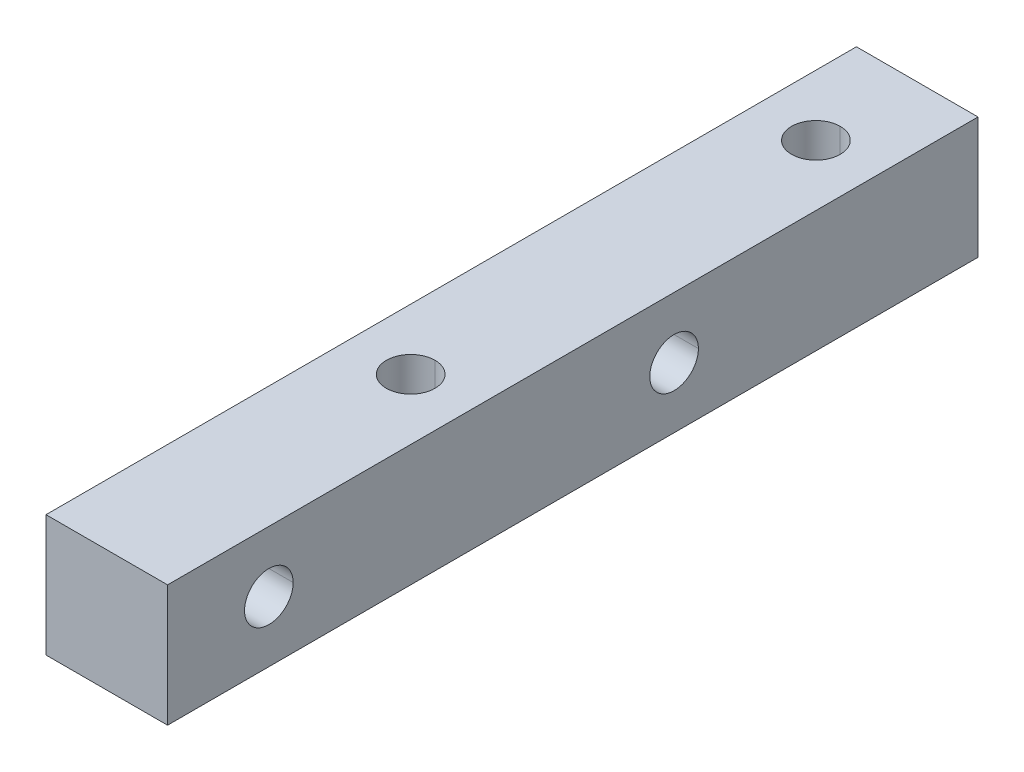
ISO-10303-21;
HEADER;
FILE_DESCRIPTION(('STEP AP214'),'2;1');
FILE_NAME('part.step','',(''),(''),'','','');
FILE_SCHEMA(('AUTOMOTIVE_DESIGN { 1 0 10303 214 1 1 1 1 }'));
ENDSEC;
DATA;
#1=APPLICATION_CONTEXT('core data for automotive mechanical design processes');
#2=APPLICATION_PROTOCOL_DEFINITION('international standard','automotive_design',2000,#1);
#3=PRODUCT_CONTEXT('',#1,'mechanical');
#4=PRODUCT('Part','Part','',(#3));
#5=PRODUCT_RELATED_PRODUCT_CATEGORY('part','',(#4));
#6=PRODUCT_DEFINITION_FORMATION('','',#4);
#7=PRODUCT_DEFINITION_CONTEXT('part definition',#1,'design');
#8=PRODUCT_DEFINITION('design','',#6,#7);
#9=PRODUCT_DEFINITION_SHAPE('','',#8);
#10=(LENGTH_UNIT() NAMED_UNIT(*) SI_UNIT(.MILLI.,.METRE.));
#11=(NAMED_UNIT(*) PLANE_ANGLE_UNIT() SI_UNIT($,.RADIAN.));
#12=(NAMED_UNIT(*) SI_UNIT($,.STERADIAN.) SOLID_ANGLE_UNIT());
#13=UNCERTAINTY_MEASURE_WITH_UNIT(LENGTH_MEASURE(1.E-05),#10,'distance_accuracy_value','');
#14=(GEOMETRIC_REPRESENTATION_CONTEXT(3) GLOBAL_UNCERTAINTY_ASSIGNED_CONTEXT((#13)) GLOBAL_UNIT_ASSIGNED_CONTEXT((#10,
#11,#12)) REPRESENTATION_CONTEXT('',''));
#15=CARTESIAN_POINT('',(0.,0.,0.));
#16=DIRECTION('',(0.,0.,1.));
#17=DIRECTION('',(1.,0.,0.));
#18=AXIS2_PLACEMENT_3D('',#15,#16,#17);
#19=CARTESIAN_POINT('',(50.,3.,35.));
#20=DIRECTION('',(-1.,0.,0.));
#21=DIRECTION('',(0.,0.,1.));
#22=AXIS2_PLACEMENT_3D('',#19,#20,#21);
#23=CYLINDRICAL_SURFACE('',#22,1.2);
#24=DIRECTION('',(-1.,0.,0.));
#25=VECTOR('',#24,1.);
#26=CARTESIAN_POINT('',(50.,3.,33.8));
#27=LINE('',#26,#25);
#28=CARTESIAN_POINT('',(6.,3.,33.8));
#29=VERTEX_POINT('',#28);
#30=CARTESIAN_POINT('',(0.,3.,33.8));
#31=VERTEX_POINT('',#30);
#32=EDGE_CURVE('E148',#29,#31,#27,.T.);
#33=ORIENTED_EDGE('',*,*,#32,.F.);
#34=CARTESIAN_POINT('',(6.,3.,35.));
#35=DIRECTION('',(-1.,0.,0.));
#36=DIRECTION('',(0.,0.,1.));
#37=AXIS2_PLACEMENT_3D('',#34,#35,#36);
#38=CIRCLE('',#37,1.2);
#39=CARTESIAN_POINT('',(6.,3.,36.2));
#40=VERTEX_POINT('',#39);
#41=EDGE_CURVE('E126',#40,#29,#38,.T.);
#42=ORIENTED_EDGE('',*,*,#41,.F.);
#43=DIRECTION('',(-1.,0.,0.));
#44=VECTOR('',#43,1.);
#45=CARTESIAN_POINT('',(50.,3.,36.2));
#46=LINE('',#45,#44);
#47=CARTESIAN_POINT('',(0.,3.,36.2));
#48=VERTEX_POINT('',#47);
#49=EDGE_CURVE('E159',#40,#48,#46,.T.);
#50=ORIENTED_EDGE('',*,*,#49,.T.);
#51=CARTESIAN_POINT('',(0.,3.,35.));
#52=DIRECTION('',(-1.,0.,0.));
#53=DIRECTION('',(0.,0.,1.));
#54=AXIS2_PLACEMENT_3D('',#51,#52,#53);
#55=CIRCLE('',#54,1.2);
#56=EDGE_CURVE('E109',#48,#31,#55,.T.);
#57=ORIENTED_EDGE('',*,*,#56,.T.);
#58=EDGE_LOOP('',(#33,#42,#50,#57));
#59=FACE_BOUND('',#58,.T.);
#60=ADVANCED_FACE('F16',(#59),#23,.F.);
#61=CARTESIAN_POINT('',(50.,3.,15.));
#62=DIRECTION('',(-1.,0.,0.));
#63=DIRECTION('',(0.,0.,1.));
#64=AXIS2_PLACEMENT_3D('',#61,#62,#63);
#65=CYLINDRICAL_SURFACE('',#64,1.2);
#66=DIRECTION('',(-1.,0.,0.));
#67=VECTOR('',#66,1.);
#68=CARTESIAN_POINT('',(50.,3.,13.8));
#69=LINE('',#68,#67);
#70=CARTESIAN_POINT('',(6.,3.,13.8));
#71=VERTEX_POINT('',#70);
#72=CARTESIAN_POINT('',(0.,3.,13.8));
#73=VERTEX_POINT('',#72);
#74=EDGE_CURVE('E168',#71,#73,#69,.T.);
#75=ORIENTED_EDGE('',*,*,#74,.F.);
#76=CARTESIAN_POINT('',(6.,3.,15.));
#77=DIRECTION('',(-1.,0.,0.));
#78=DIRECTION('',(0.,0.,1.));
#79=AXIS2_PLACEMENT_3D('',#76,#77,#78);
#80=CIRCLE('',#79,1.2);
#81=CARTESIAN_POINT('',(6.,3.,16.2));
#82=VERTEX_POINT('',#81);
#83=EDGE_CURVE('E132',#82,#71,#80,.T.);
#84=ORIENTED_EDGE('',*,*,#83,.F.);
#85=DIRECTION('',(-1.,0.,0.));
#86=VECTOR('',#85,1.);
#87=CARTESIAN_POINT('',(50.,3.,16.2));
#88=LINE('',#87,#86);
#89=CARTESIAN_POINT('',(0.,3.,16.2));
#90=VERTEX_POINT('',#89);
#91=EDGE_CURVE('E176',#82,#90,#88,.T.);
#92=ORIENTED_EDGE('',*,*,#91,.T.);
#93=CARTESIAN_POINT('',(0.,3.,15.));
#94=DIRECTION('',(-1.,0.,0.));
#95=DIRECTION('',(0.,0.,1.));
#96=AXIS2_PLACEMENT_3D('',#93,#94,#95);
#97=CIRCLE('',#96,1.2);
#98=EDGE_CURVE('E102',#90,#73,#97,.T.);
#99=ORIENTED_EDGE('',*,*,#98,.T.);
#100=EDGE_LOOP('',(#75,#84,#92,#99));
#101=FACE_BOUND('',#100,.T.);
#102=ADVANCED_FACE('F313',(#101),#65,.F.);
#103=CARTESIAN_POINT('',(3.,-44.,5.));
#104=DIRECTION('',(0.,1.,0.));
#105=DIRECTION('',(0.,0.,1.));
#106=AXIS2_PLACEMENT_3D('',#103,#104,#105);
#107=CYLINDRICAL_SURFACE('',#106,1.2);
#108=DIRECTION('',(0.,1.,0.));
#109=VECTOR('',#108,1.);
#110=CARTESIAN_POINT('',(3.,-44.,3.8));
#111=LINE('',#110,#109);
#112=CARTESIAN_POINT('',(3.,0.,3.8));
#113=VERTEX_POINT('',#112);
#114=CARTESIAN_POINT('',(3.,6.,3.8));
#115=VERTEX_POINT('',#114);
#116=EDGE_CURVE('E163',#113,#115,#111,.T.);
#117=ORIENTED_EDGE('',*,*,#116,.F.);
#118=CARTESIAN_POINT('',(3.,0.,5.));
#119=DIRECTION('',(0.,1.,0.));
#120=DIRECTION('',(0.,0.,1.));
#121=AXIS2_PLACEMENT_3D('',#118,#119,#120);
#122=CIRCLE('',#121,1.2);
#123=CARTESIAN_POINT('',(3.,0.,6.2));
#124=VERTEX_POINT('',#123);
#125=EDGE_CURVE('E114',#124,#113,#122,.T.);
#126=ORIENTED_EDGE('',*,*,#125,.F.);
#127=DIRECTION('',(0.,1.,0.));
#128=VECTOR('',#127,1.);
#129=CARTESIAN_POINT('',(3.,-44.,6.2));
#130=LINE('',#129,#128);
#131=CARTESIAN_POINT('',(3.,6.,6.2));
#132=VERTEX_POINT('',#131);
#133=EDGE_CURVE('E150',#124,#132,#130,.T.);
#134=ORIENTED_EDGE('',*,*,#133,.T.);
#135=CARTESIAN_POINT('',(3.,6.,5.));
#136=DIRECTION('',(0.,1.,0.));
#137=DIRECTION('',(0.,0.,1.));
#138=AXIS2_PLACEMENT_3D('',#135,#136,#137);
#139=CIRCLE('',#138,1.2);
#140=EDGE_CURVE('E24',#132,#115,#139,.T.);
#141=ORIENTED_EDGE('',*,*,#140,.T.);
#142=EDGE_LOOP('',(#117,#126,#134,#141));
#143=FACE_BOUND('',#142,.T.);
#144=ADVANCED_FACE('F261',(#143),#107,.F.);
#145=CARTESIAN_POINT('',(3.,-44.,25.));
#146=DIRECTION('',(0.,1.,0.));
#147=DIRECTION('',(0.,0.,1.));
#148=AXIS2_PLACEMENT_3D('',#145,#146,#147);
#149=CYLINDRICAL_SURFACE('',#148,1.2);
#150=DIRECTION('',(0.,1.,0.));
#151=VECTOR('',#150,1.);
#152=CARTESIAN_POINT('',(3.,-44.,23.8));
#153=LINE('',#152,#151);
#154=CARTESIAN_POINT('',(3.,0.,23.8));
#155=VERTEX_POINT('',#154);
#156=CARTESIAN_POINT('',(3.,6.,23.8));
#157=VERTEX_POINT('',#156);
#158=EDGE_CURVE('E187',#155,#157,#153,.T.);
#159=ORIENTED_EDGE('',*,*,#158,.F.);
#160=CARTESIAN_POINT('',(3.,0.,25.));
#161=DIRECTION('',(0.,1.,0.));
#162=DIRECTION('',(0.,0.,1.));
#163=AXIS2_PLACEMENT_3D('',#160,#161,#162);
#164=CIRCLE('',#163,1.2);
#165=CARTESIAN_POINT('',(3.,0.,26.2));
#166=VERTEX_POINT('',#165);
#167=EDGE_CURVE('E86',#166,#155,#164,.T.);
#168=ORIENTED_EDGE('',*,*,#167,.F.);
#169=DIRECTION('',(0.,1.,0.));
#170=VECTOR('',#169,1.);
#171=CARTESIAN_POINT('',(3.,-44.,26.2));
#172=LINE('',#171,#170);
#173=CARTESIAN_POINT('',(3.,6.,26.2));
#174=VERTEX_POINT('',#173);
#175=EDGE_CURVE('E192',#166,#174,#172,.T.);
#176=ORIENTED_EDGE('',*,*,#175,.T.);
#177=CARTESIAN_POINT('',(3.,6.,25.));
#178=DIRECTION('',(0.,1.,0.));
#179=DIRECTION('',(0.,0.,1.));
#180=AXIS2_PLACEMENT_3D('',#177,#178,#179);
#181=CIRCLE('',#180,1.2);
#182=EDGE_CURVE('E10',#174,#157,#181,.T.);
#183=ORIENTED_EDGE('',*,*,#182,.T.);
#184=EDGE_LOOP('',(#159,#168,#176,#183));
#185=FACE_BOUND('',#184,.T.);
#186=ADVANCED_FACE('F342',(#185),#149,.F.);
#187=CARTESIAN_POINT('',(0.,0.,0.));
#188=DIRECTION('',(0.,0.,-1.));
#189=DIRECTION('',(0.,-1.,0.));
#190=AXIS2_PLACEMENT_3D('',#187,#188,#189);
#191=PLANE('',#190);
#192=DIRECTION('',(0.,-1.,0.));
#193=VECTOR('',#192,1.);
#194=CARTESIAN_POINT('',(0.,0.,0.));
#195=LINE('',#194,#193);
#196=CARTESIAN_POINT('',(0.,6.,0.));
#197=VERTEX_POINT('',#196);
#198=CARTESIAN_POINT('',(0.,0.,0.));
#199=VERTEX_POINT('',#198);
#200=EDGE_CURVE('E196',#197,#199,#195,.T.);
#201=ORIENTED_EDGE('',*,*,#200,.F.);
#202=DIRECTION('',(-1.,0.,0.));
#203=VECTOR('',#202,1.);
#204=CARTESIAN_POINT('',(0.,6.,0.));
#205=LINE('',#204,#203);
#206=CARTESIAN_POINT('',(6.,6.,0.));
#207=VERTEX_POINT('',#206);
#208=EDGE_CURVE('E51',#207,#197,#205,.T.);
#209=ORIENTED_EDGE('',*,*,#208,.F.);
#210=DIRECTION('',(0.,1.,0.));
#211=VECTOR('',#210,1.);
#212=CARTESIAN_POINT('',(6.,0.,0.));
#213=LINE('',#212,#211);
#214=CARTESIAN_POINT('',(6.,0.,0.));
#215=VERTEX_POINT('',#214);
#216=EDGE_CURVE('E76',#215,#207,#213,.T.);
#217=ORIENTED_EDGE('',*,*,#216,.F.);
#218=DIRECTION('',(1.,0.,0.));
#219=VECTOR('',#218,1.);
#220=CARTESIAN_POINT('',(0.,0.,0.));
#221=LINE('',#220,#219);
#222=EDGE_CURVE('E80',#199,#215,#221,.T.);
#223=ORIENTED_EDGE('',*,*,#222,.F.);
#224=EDGE_LOOP('',(#201,#209,#217,#223));
#225=FACE_BOUND('',#224,.T.);
#226=ADVANCED_FACE('F78',(#225),#191,.T.);
#227=CARTESIAN_POINT('',(0.,0.,40.));
#228=DIRECTION('',(0.,0.,-1.));
#229=DIRECTION('',(0.,-1.,0.));
#230=AXIS2_PLACEMENT_3D('',#227,#228,#229);
#231=PLANE('',#230);
#232=DIRECTION('',(0.,-1.,0.));
#233=VECTOR('',#232,1.);
#234=CARTESIAN_POINT('',(0.,0.,40.));
#235=LINE('',#234,#233);
#236=CARTESIAN_POINT('',(0.,6.,40.));
#237=VERTEX_POINT('',#236);
#238=CARTESIAN_POINT('',(0.,0.,40.));
#239=VERTEX_POINT('',#238);
#240=EDGE_CURVE('E201',#237,#239,#235,.T.);
#241=ORIENTED_EDGE('',*,*,#240,.T.);
#242=DIRECTION('',(1.,0.,0.));
#243=VECTOR('',#242,1.);
#244=CARTESIAN_POINT('',(0.,0.,40.));
#245=LINE('',#244,#243);
#246=CARTESIAN_POINT('',(6.,0.,40.));
#247=VERTEX_POINT('',#246);
#248=EDGE_CURVE('E95',#239,#247,#245,.T.);
#249=ORIENTED_EDGE('',*,*,#248,.T.);
#250=DIRECTION('',(0.,1.,0.));
#251=VECTOR('',#250,1.);
#252=CARTESIAN_POINT('',(6.,0.,40.));
#253=LINE('',#252,#251);
#254=CARTESIAN_POINT('',(6.,6.,40.));
#255=VERTEX_POINT('',#254);
#256=EDGE_CURVE('E91',#247,#255,#253,.T.);
#257=ORIENTED_EDGE('',*,*,#256,.T.);
#258=DIRECTION('',(-1.,0.,0.));
#259=VECTOR('',#258,1.);
#260=CARTESIAN_POINT('',(0.,6.,40.));
#261=LINE('',#260,#259);
#262=EDGE_CURVE('E37',#255,#237,#261,.T.);
#263=ORIENTED_EDGE('',*,*,#262,.T.);
#264=EDGE_LOOP('',(#241,#249,#257,#263));
#265=FACE_BOUND('',#264,.T.);
#266=ADVANCED_FACE('F329',(#265),#231,.F.);
#267=CARTESIAN_POINT('',(0.,6.,40.));
#268=DIRECTION('',(0.,-1.,0.));
#269=DIRECTION('',(0.,0.,-1.));
#270=AXIS2_PLACEMENT_3D('',#267,#268,#269);
#271=PLANE('',#270);
#272=ORIENTED_EDGE('',*,*,#182,.F.);
#273=CARTESIAN_POINT('',(3.,6.,25.));
#274=DIRECTION('',(0.,1.,0.));
#275=DIRECTION('',(0.,0.,1.));
#276=AXIS2_PLACEMENT_3D('',#273,#274,#275);
#277=CIRCLE('',#276,1.2);
#278=EDGE_CURVE('E188',#157,#174,#277,.T.);
#279=ORIENTED_EDGE('',*,*,#278,.F.);
#280=EDGE_LOOP('',(#272,#279));
#281=FACE_BOUND('',#280,.T.);
#282=ORIENTED_EDGE('',*,*,#140,.F.);
#283=CARTESIAN_POINT('',(3.,6.,5.));
#284=DIRECTION('',(0.,1.,0.));
#285=DIRECTION('',(0.,0.,1.));
#286=AXIS2_PLACEMENT_3D('',#283,#284,#285);
#287=CIRCLE('',#286,1.2);
#288=EDGE_CURVE('E154',#115,#132,#287,.T.);
#289=ORIENTED_EDGE('',*,*,#288,.F.);
#290=EDGE_LOOP('',(#282,#289));
#291=FACE_BOUND('',#290,.T.);
#292=ORIENTED_EDGE('',*,*,#208,.T.);
#293=DIRECTION('',(0.,0.,-1.));
#294=VECTOR('',#293,1.);
#295=CARTESIAN_POINT('',(0.,6.,40.));
#296=LINE('',#295,#294);
#297=EDGE_CURVE('E207',#237,#197,#296,.T.);
#298=ORIENTED_EDGE('',*,*,#297,.F.);
#299=ORIENTED_EDGE('',*,*,#262,.F.);
#300=DIRECTION('',(0.,0.,-1.));
#301=VECTOR('',#300,1.);
#302=CARTESIAN_POINT('',(6.,6.,40.));
#303=LINE('',#302,#301);
#304=EDGE_CURVE('E85',#255,#207,#303,.T.);
#305=ORIENTED_EDGE('',*,*,#304,.T.);
#306=EDGE_LOOP('',(#292,#298,#299,#305));
#307=FACE_BOUND('',#306,.T.);
#308=ADVANCED_FACE('F321',(#281,#291,#307),#271,.F.);
#309=CARTESIAN_POINT('',(6.,0.,40.));
#310=DIRECTION('',(-1.,0.,0.));
#311=DIRECTION('',(0.,0.,1.));
#312=AXIS2_PLACEMENT_3D('',#309,#310,#311);
#313=PLANE('',#312);
#314=ORIENTED_EDGE('',*,*,#83,.T.);
#315=CARTESIAN_POINT('',(6.,3.,15.));
#316=DIRECTION('',(-1.,0.,0.));
#317=DIRECTION('',(0.,0.,1.));
#318=AXIS2_PLACEMENT_3D('',#315,#316,#317);
#319=CIRCLE('',#318,1.2);
#320=EDGE_CURVE('E164',#71,#82,#319,.T.);
#321=ORIENTED_EDGE('',*,*,#320,.T.);
#322=EDGE_LOOP('',(#314,#321));
#323=FACE_BOUND('',#322,.T.);
#324=ORIENTED_EDGE('',*,*,#41,.T.);
#325=CARTESIAN_POINT('',(6.,3.,35.));
#326=DIRECTION('',(-1.,0.,0.));
#327=DIRECTION('',(0.,0.,1.));
#328=AXIS2_PLACEMENT_3D('',#325,#326,#327);
#329=CIRCLE('',#328,1.2);
#330=EDGE_CURVE('E233',#29,#40,#329,.T.);
#331=ORIENTED_EDGE('',*,*,#330,.T.);
#332=EDGE_LOOP('',(#324,#331));
#333=FACE_BOUND('',#332,.T.);
#334=ORIENTED_EDGE('',*,*,#216,.T.);
#335=ORIENTED_EDGE('',*,*,#304,.F.);
#336=ORIENTED_EDGE('',*,*,#256,.F.);
#337=DIRECTION('',(0.,0.,-1.));
#338=VECTOR('',#337,1.);
#339=CARTESIAN_POINT('',(6.,0.,40.));
#340=LINE('',#339,#338);
#341=EDGE_CURVE('E89',#247,#215,#340,.T.);
#342=ORIENTED_EDGE('',*,*,#341,.T.);
#343=EDGE_LOOP('',(#334,#335,#336,#342));
#344=FACE_BOUND('',#343,.T.);
#345=ADVANCED_FACE('F90',(#323,#333,#344),#313,.F.);
#346=CARTESIAN_POINT('',(0.,0.,40.));
#347=DIRECTION('',(0.,1.,0.));
#348=DIRECTION('',(1.,0.,0.));
#349=AXIS2_PLACEMENT_3D('',#346,#347,#348);
#350=PLANE('',#349);
#351=ORIENTED_EDGE('',*,*,#167,.T.);
#352=CARTESIAN_POINT('',(3.,0.,25.));
#353=DIRECTION('',(0.,1.,0.));
#354=DIRECTION('',(0.,0.,1.));
#355=AXIS2_PLACEMENT_3D('',#352,#353,#354);
#356=CIRCLE('',#355,1.2);
#357=EDGE_CURVE('E153',#155,#166,#356,.T.);
#358=ORIENTED_EDGE('',*,*,#357,.T.);
#359=EDGE_LOOP('',(#351,#358));
#360=FACE_BOUND('',#359,.T.);
#361=ORIENTED_EDGE('',*,*,#125,.T.);
#362=CARTESIAN_POINT('',(3.,0.,5.));
#363=DIRECTION('',(0.,1.,0.));
#364=DIRECTION('',(0.,0.,1.));
#365=AXIS2_PLACEMENT_3D('',#362,#363,#364);
#366=CIRCLE('',#365,1.2);
#367=EDGE_CURVE('E180',#113,#124,#366,.T.);
#368=ORIENTED_EDGE('',*,*,#367,.T.);
#369=EDGE_LOOP('',(#361,#368));
#370=FACE_BOUND('',#369,.T.);
#371=ORIENTED_EDGE('',*,*,#222,.T.);
#372=ORIENTED_EDGE('',*,*,#341,.F.);
#373=ORIENTED_EDGE('',*,*,#248,.F.);
#374=DIRECTION('',(0.,0.,-1.));
#375=VECTOR('',#374,1.);
#376=CARTESIAN_POINT('',(0.,0.,40.));
#377=LINE('',#376,#375);
#378=EDGE_CURVE('E99',#239,#199,#377,.T.);
#379=ORIENTED_EDGE('',*,*,#378,.T.);
#380=EDGE_LOOP('',(#371,#372,#373,#379));
#381=FACE_BOUND('',#380,.T.);
#382=ADVANCED_FACE('F97',(#360,#370,#381),#350,.F.);
#383=CARTESIAN_POINT('',(0.,0.,40.));
#384=DIRECTION('',(1.,0.,0.));
#385=DIRECTION('',(0.,1.,0.));
#386=AXIS2_PLACEMENT_3D('',#383,#384,#385);
#387=PLANE('',#386);
#388=ORIENTED_EDGE('',*,*,#98,.F.);
#389=CARTESIAN_POINT('',(0.,3.,15.));
#390=DIRECTION('',(-1.,0.,0.));
#391=DIRECTION('',(0.,0.,1.));
#392=AXIS2_PLACEMENT_3D('',#389,#390,#391);
#393=CIRCLE('',#392,1.2);
#394=EDGE_CURVE('E172',#73,#90,#393,.T.);
#395=ORIENTED_EDGE('',*,*,#394,.F.);
#396=EDGE_LOOP('',(#388,#395));
#397=FACE_BOUND('',#396,.T.);
#398=ORIENTED_EDGE('',*,*,#56,.F.);
#399=CARTESIAN_POINT('',(0.,3.,35.));
#400=DIRECTION('',(-1.,0.,0.));
#401=DIRECTION('',(0.,0.,1.));
#402=AXIS2_PLACEMENT_3D('',#399,#400,#401);
#403=CIRCLE('',#402,1.2);
#404=EDGE_CURVE('E155',#31,#48,#403,.T.);
#405=ORIENTED_EDGE('',*,*,#404,.F.);
#406=EDGE_LOOP('',(#398,#405));
#407=FACE_BOUND('',#406,.T.);
#408=ORIENTED_EDGE('',*,*,#200,.T.);
#409=ORIENTED_EDGE('',*,*,#378,.F.);
#410=ORIENTED_EDGE('',*,*,#240,.F.);
#411=ORIENTED_EDGE('',*,*,#297,.T.);
#412=EDGE_LOOP('',(#408,#409,#410,#411));
#413=FACE_BOUND('',#412,.T.);
#414=ADVANCED_FACE('F229',(#397,#407,#413),#387,.F.);
#415=CARTESIAN_POINT('',(3.,-44.,25.));
#416=DIRECTION('',(0.,1.,0.));
#417=DIRECTION('',(0.,0.,1.));
#418=AXIS2_PLACEMENT_3D('',#415,#416,#417);
#419=CYLINDRICAL_SURFACE('',#418,1.2);
#420=ORIENTED_EDGE('',*,*,#357,.F.);
#421=ORIENTED_EDGE('',*,*,#158,.T.);
#422=ORIENTED_EDGE('',*,*,#278,.T.);
#423=ORIENTED_EDGE('',*,*,#175,.F.);
#424=EDGE_LOOP('',(#420,#421,#422,#423));
#425=FACE_BOUND('',#424,.T.);
#426=ADVANCED_FACE('F344',(#425),#419,.F.);
#427=CARTESIAN_POINT('',(3.,-44.,5.));
#428=DIRECTION('',(0.,1.,0.));
#429=DIRECTION('',(0.,0.,1.));
#430=AXIS2_PLACEMENT_3D('',#427,#428,#429);
#431=CYLINDRICAL_SURFACE('',#430,1.2);
#432=ORIENTED_EDGE('',*,*,#367,.F.);
#433=ORIENTED_EDGE('',*,*,#116,.T.);
#434=ORIENTED_EDGE('',*,*,#288,.T.);
#435=ORIENTED_EDGE('',*,*,#133,.F.);
#436=EDGE_LOOP('',(#432,#433,#434,#435));
#437=FACE_BOUND('',#436,.T.);
#438=ADVANCED_FACE('F251',(#437),#431,.F.);
#439=CARTESIAN_POINT('',(50.,3.,15.));
#440=DIRECTION('',(-1.,0.,0.));
#441=DIRECTION('',(0.,0.,1.));
#442=AXIS2_PLACEMENT_3D('',#439,#440,#441);
#443=CYLINDRICAL_SURFACE('',#442,1.2);
#444=ORIENTED_EDGE('',*,*,#320,.F.);
#445=ORIENTED_EDGE('',*,*,#74,.T.);
#446=ORIENTED_EDGE('',*,*,#394,.T.);
#447=ORIENTED_EDGE('',*,*,#91,.F.);
#448=EDGE_LOOP('',(#444,#445,#446,#447));
#449=FACE_BOUND('',#448,.T.);
#450=ADVANCED_FACE('F318',(#449),#443,.F.);
#451=CARTESIAN_POINT('',(50.,3.,35.));
#452=DIRECTION('',(-1.,0.,0.));
#453=DIRECTION('',(0.,0.,1.));
#454=AXIS2_PLACEMENT_3D('',#451,#452,#453);
#455=CYLINDRICAL_SURFACE('',#454,1.2);
#456=ORIENTED_EDGE('',*,*,#330,.F.);
#457=ORIENTED_EDGE('',*,*,#32,.T.);
#458=ORIENTED_EDGE('',*,*,#404,.T.);
#459=ORIENTED_EDGE('',*,*,#49,.F.);
#460=EDGE_LOOP('',(#456,#457,#458,#459));
#461=FACE_BOUND('',#460,.T.);
#462=ADVANCED_FACE('F232',(#461),#455,.F.);
#463=CLOSED_SHELL('',(#60,#102,#144,#186,#226,#266,#308,#345,#382,#414,#426,#438,#450,#462));
#464=MANIFOLD_SOLID_BREP('B1',#463);
#465=ADVANCED_BREP_SHAPE_REPRESENTATION('',(#18,#464),#14);
#466=SHAPE_DEFINITION_REPRESENTATION(#9,#465);
ENDSEC;
END-ISO-10303-21;
